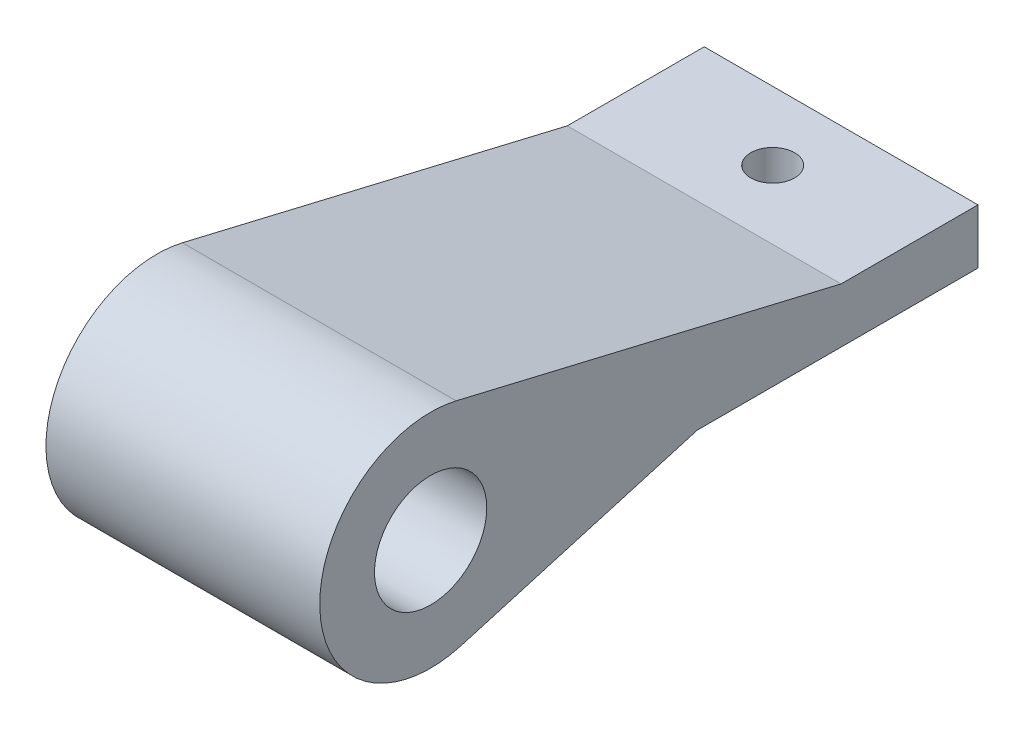
ISO-10303-21;
HEADER;
FILE_DESCRIPTION(('STEP AP214'),'2;1');
FILE_NAME('part.step','',(''),(''),'','','');
FILE_SCHEMA(('AUTOMOTIVE_DESIGN { 1 0 10303 214 1 1 1 1 }'));
ENDSEC;
DATA;
#1=APPLICATION_CONTEXT('core data for automotive mechanical design processes');
#2=APPLICATION_PROTOCOL_DEFINITION('international standard','automotive_design',2000,#1);
#3=PRODUCT_CONTEXT('',#1,'mechanical');
#4=PRODUCT('Part','Part','',(#3));
#5=PRODUCT_RELATED_PRODUCT_CATEGORY('part','',(#4));
#6=PRODUCT_DEFINITION_FORMATION('','',#4);
#7=PRODUCT_DEFINITION_CONTEXT('part definition',#1,'design');
#8=PRODUCT_DEFINITION('design','',#6,#7);
#9=PRODUCT_DEFINITION_SHAPE('','',#8);
#10=(LENGTH_UNIT() NAMED_UNIT(*) SI_UNIT(.MILLI.,.METRE.));
#11=(NAMED_UNIT(*) PLANE_ANGLE_UNIT() SI_UNIT($,.RADIAN.));
#12=(NAMED_UNIT(*) SI_UNIT($,.STERADIAN.) SOLID_ANGLE_UNIT());
#13=UNCERTAINTY_MEASURE_WITH_UNIT(LENGTH_MEASURE(1.E-05),#10,'distance_accuracy_value','');
#14=(GEOMETRIC_REPRESENTATION_CONTEXT(3) GLOBAL_UNCERTAINTY_ASSIGNED_CONTEXT((#13)) GLOBAL_UNIT_ASSIGNED_CONTEXT((#10,
#11,#12)) REPRESENTATION_CONTEXT('',''));
#15=CARTESIAN_POINT('',(0.,0.,0.));
#16=DIRECTION('',(0.,0.,1.));
#17=DIRECTION('',(1.,0.,0.));
#18=AXIS2_PLACEMENT_3D('',#15,#16,#17);
#19=CARTESIAN_POINT('',(20.,2.77903380821613,29.7363308106528));
#20=DIRECTION('',(1.,0.,0.));
#21=DIRECTION('',(0.,0.,-1.));
#22=AXIS2_PLACEMENT_3D('',#19,#20,#21);
#23=PLANE('',#22);
#24=DIRECTION('',(0.,0.278712638404029,-0.960374544224213));
#25=VECTOR('',#24,1.);
#26=CARTESIAN_POINT('',(20.,0.,10.25));
#27=LINE('',#26,#25);
#28=CARTESIAN_POINT('',(20.,-5.,27.4787584395802));
#29=VERTEX_POINT('',#28);
#30=CARTESIAN_POINT('',(20.,0.,10.25));
#31=VERTEX_POINT('',#30);
#32=EDGE_CURVE('E152',#29,#31,#27,.T.);
#33=ORIENTED_EDGE('',*,*,#32,.T.);
#34=DIRECTION('',(0.,0.,-1.));
#35=VECTOR('',#34,1.);
#36=CARTESIAN_POINT('',(20.,0.,10.25));
#37=LINE('',#36,#35);
#38=CARTESIAN_POINT('',(20.,0.,-10.25));
#39=VERTEX_POINT('',#38);
#40=EDGE_CURVE('E100',#31,#39,#37,.T.);
#41=ORIENTED_EDGE('',*,*,#40,.T.);
#42=DIRECTION('',(0.,1.,0.));
#43=VECTOR('',#42,1.);
#44=CARTESIAN_POINT('',(20.,4.,-10.25));
#45=LINE('',#44,#43);
#46=CARTESIAN_POINT('',(20.,4.,-10.25));
#47=VERTEX_POINT('',#46);
#48=EDGE_CURVE('E113',#39,#47,#45,.T.);
#49=ORIENTED_EDGE('',*,*,#48,.T.);
#50=DIRECTION('',(0.,0.,1.));
#51=VECTOR('',#50,1.);
#52=CARTESIAN_POINT('',(20.,4.,-0.249999999999997));
#53=LINE('',#52,#51);
#54=CARTESIAN_POINT('',(20.,4.,-0.249999999999997));
#55=VERTEX_POINT('',#54);
#56=EDGE_CURVE('E107',#47,#55,#53,.T.);
#57=ORIENTED_EDGE('',*,*,#56,.T.);
#58=DIRECTION('',(0.,0.230502099091851,0.973071827931654));
#59=VECTOR('',#58,1.);
#60=CARTESIAN_POINT('',(20.,4.,-0.249999999999997));
#61=LINE('',#60,#59);
#62=CARTESIAN_POINT('',(20.,10.6609156144625,27.8692638080088));
#63=VERTEX_POINT('',#62);
#64=EDGE_CURVE('E111',#55,#63,#61,.T.);
#65=ORIENTED_EDGE('',*,*,#64,.T.);
#66=CARTESIAN_POINT('',(20.,2.77903380821613,29.7363308106528));
#67=DIRECTION('',(1.,0.,0.));
#68=DIRECTION('',(0.,0.,-1.));
#69=AXIS2_PLACEMENT_3D('',#66,#67,#68);
#70=CIRCLE('',#69,8.1);
#71=EDGE_CURVE('E63',#63,#29,#70,.T.);
#72=ORIENTED_EDGE('',*,*,#71,.T.);
#73=EDGE_LOOP('',(#33,#41,#49,#57,#65,#72));
#74=FACE_BOUND('',#73,.T.);
#75=CARTESIAN_POINT('',(20.,2.77903380821613,29.7363308106528));
#76=DIRECTION('',(1.,0.,0.));
#77=DIRECTION('',(0.,0.,-1.));
#78=AXIS2_PLACEMENT_3D('',#75,#76,#77);
#79=CIRCLE('',#78,4.1);
#80=CARTESIAN_POINT('',(20.,2.77903380821613,25.6363308106528));
#81=VERTEX_POINT('',#80);
#82=EDGE_CURVE('E140',#81,#81,#79,.T.);
#83=ORIENTED_EDGE('',*,*,#82,.F.);
#84=EDGE_LOOP('',(#83));
#85=FACE_BOUND('',#84,.T.);
#86=ADVANCED_FACE('F45',(#74,#85),#23,.T.);
#87=CARTESIAN_POINT('',(0.,2.77903380821613,29.7363308106528));
#88=DIRECTION('',(1.,0.,0.));
#89=DIRECTION('',(0.,0.,-1.));
#90=AXIS2_PLACEMENT_3D('',#87,#88,#89);
#91=PLANE('',#90);
#92=DIRECTION('',(0.,0.278712638404029,-0.960374544224213));
#93=VECTOR('',#92,1.);
#94=CARTESIAN_POINT('',(0.,0.,10.25));
#95=LINE('',#94,#93);
#96=CARTESIAN_POINT('',(0.,-5.,27.4787584395802));
#97=VERTEX_POINT('',#96);
#98=CARTESIAN_POINT('',(0.,0.,10.25));
#99=VERTEX_POINT('',#98);
#100=EDGE_CURVE('E135',#97,#99,#95,.T.);
#101=ORIENTED_EDGE('',*,*,#100,.F.);
#102=CARTESIAN_POINT('',(0.,2.77903380821613,29.7363308106528));
#103=DIRECTION('',(1.,0.,0.));
#104=DIRECTION('',(0.,0.,-1.));
#105=AXIS2_PLACEMENT_3D('',#102,#103,#104);
#106=CIRCLE('',#105,8.1);
#107=CARTESIAN_POINT('',(0.,10.6609156144625,27.8692638080088));
#108=VERTEX_POINT('',#107);
#109=EDGE_CURVE('E92',#108,#97,#106,.T.);
#110=ORIENTED_EDGE('',*,*,#109,.F.);
#111=DIRECTION('',(0.,0.230502099091851,0.973071827931654));
#112=VECTOR('',#111,1.);
#113=CARTESIAN_POINT('',(0.,4.,-0.249999999999997));
#114=LINE('',#113,#112);
#115=CARTESIAN_POINT('',(0.,4.,-0.249999999999997));
#116=VERTEX_POINT('',#115);
#117=EDGE_CURVE('E86',#116,#108,#114,.T.);
#118=ORIENTED_EDGE('',*,*,#117,.F.);
#119=DIRECTION('',(0.,0.,1.));
#120=VECTOR('',#119,1.);
#121=CARTESIAN_POINT('',(0.,4.,-0.249999999999997));
#122=LINE('',#121,#120);
#123=CARTESIAN_POINT('',(0.,4.,-10.25));
#124=VERTEX_POINT('',#123);
#125=EDGE_CURVE('E122',#124,#116,#122,.T.);
#126=ORIENTED_EDGE('',*,*,#125,.F.);
#127=DIRECTION('',(0.,1.,0.));
#128=VECTOR('',#127,1.);
#129=CARTESIAN_POINT('',(0.,4.,-10.25));
#130=LINE('',#129,#128);
#131=CARTESIAN_POINT('',(0.,0.,-10.25));
#132=VERTEX_POINT('',#131);
#133=EDGE_CURVE('E143',#132,#124,#130,.T.);
#134=ORIENTED_EDGE('',*,*,#133,.F.);
#135=DIRECTION('',(0.,0.,-1.));
#136=VECTOR('',#135,1.);
#137=CARTESIAN_POINT('',(0.,0.,10.25));
#138=LINE('',#137,#136);
#139=EDGE_CURVE('E139',#99,#132,#138,.T.);
#140=ORIENTED_EDGE('',*,*,#139,.F.);
#141=EDGE_LOOP('',(#101,#110,#118,#126,#134,#140));
#142=FACE_BOUND('',#141,.T.);
#143=CARTESIAN_POINT('',(0.,2.77903380821613,29.7363308106528));
#144=DIRECTION('',(1.,0.,0.));
#145=DIRECTION('',(0.,0.,-1.));
#146=AXIS2_PLACEMENT_3D('',#143,#144,#145);
#147=CIRCLE('',#146,4.1);
#148=CARTESIAN_POINT('',(0.,2.77903380821613,25.6363308106528));
#149=VERTEX_POINT('',#148);
#150=EDGE_CURVE('E202',#149,#149,#147,.T.);
#151=ORIENTED_EDGE('',*,*,#150,.T.);
#152=EDGE_LOOP('',(#151));
#153=FACE_BOUND('',#152,.T.);
#154=ADVANCED_FACE('F165',(#142,#153),#91,.F.);
#155=CARTESIAN_POINT('',(20.,0.,10.25));
#156=DIRECTION('',(0.,0.960374544224213,0.278712638404029));
#157=DIRECTION('',(0.,-0.278712638404029,0.960374544224213));
#158=AXIS2_PLACEMENT_3D('',#155,#156,#157);
#159=PLANE('',#158);
#160=ORIENTED_EDGE('',*,*,#100,.T.);
#161=DIRECTION('',(-1.,0.,0.));
#162=VECTOR('',#161,1.);
#163=CARTESIAN_POINT('',(20.,0.,10.25));
#164=LINE('',#163,#162);
#165=EDGE_CURVE('E11',#31,#99,#164,.T.);
#166=ORIENTED_EDGE('',*,*,#165,.F.);
#167=ORIENTED_EDGE('',*,*,#32,.F.);
#168=DIRECTION('',(-1.,0.,0.));
#169=VECTOR('',#168,1.);
#170=CARTESIAN_POINT('',(20.,-5.,27.4787584395802));
#171=LINE('',#170,#169);
#172=EDGE_CURVE('E131',#29,#97,#171,.T.);
#173=ORIENTED_EDGE('',*,*,#172,.T.);
#174=EDGE_LOOP('',(#160,#166,#167,#173));
#175=FACE_BOUND('',#174,.T.);
#176=ADVANCED_FACE('F47',(#175),#159,.F.);
#177=CARTESIAN_POINT('',(20.,0.,10.25));
#178=DIRECTION('',(0.,1.,0.));
#179=DIRECTION('',(0.,0.,1.));
#180=AXIS2_PLACEMENT_3D('',#177,#178,#179);
#181=PLANE('',#180);
#182=CARTESIAN_POINT('',(10.,0.,-5.25));
#183=DIRECTION('',(0.,1.,0.));
#184=DIRECTION('',(0.,0.,1.));
#185=AXIS2_PLACEMENT_3D('',#182,#183,#184);
#186=CIRCLE('',#185,1.6);
#187=CARTESIAN_POINT('',(10.,0.,-3.65));
#188=VERTEX_POINT('',#187);
#189=EDGE_CURVE('E199',#188,#188,#186,.T.);
#190=ORIENTED_EDGE('',*,*,#189,.T.);
#191=EDGE_LOOP('',(#190));
#192=FACE_BOUND('',#191,.T.);
#193=ORIENTED_EDGE('',*,*,#139,.T.);
#194=DIRECTION('',(-1.,0.,0.));
#195=VECTOR('',#194,1.);
#196=CARTESIAN_POINT('',(20.,0.,-10.25));
#197=LINE('',#196,#195);
#198=EDGE_CURVE('E55',#39,#132,#197,.T.);
#199=ORIENTED_EDGE('',*,*,#198,.F.);
#200=ORIENTED_EDGE('',*,*,#40,.F.);
#201=ORIENTED_EDGE('',*,*,#165,.T.);
#202=EDGE_LOOP('',(#193,#199,#200,#201));
#203=FACE_BOUND('',#202,.T.);
#204=ADVANCED_FACE('F220',(#192,#203),#181,.F.);
#205=CARTESIAN_POINT('',(20.,4.,-10.25));
#206=DIRECTION('',(0.,0.,1.));
#207=DIRECTION('',(0.,-1.,0.));
#208=AXIS2_PLACEMENT_3D('',#205,#206,#207);
#209=PLANE('',#208);
#210=ORIENTED_EDGE('',*,*,#133,.T.);
#211=DIRECTION('',(-1.,0.,0.));
#212=VECTOR('',#211,1.);
#213=CARTESIAN_POINT('',(20.,4.,-10.25));
#214=LINE('',#213,#212);
#215=EDGE_CURVE('E124',#47,#124,#214,.T.);
#216=ORIENTED_EDGE('',*,*,#215,.F.);
#217=ORIENTED_EDGE('',*,*,#48,.F.);
#218=ORIENTED_EDGE('',*,*,#198,.T.);
#219=EDGE_LOOP('',(#210,#216,#217,#218));
#220=FACE_BOUND('',#219,.T.);
#221=ADVANCED_FACE('F162',(#220),#209,.F.);
#222=CARTESIAN_POINT('',(20.,4.,-0.249999999999997));
#223=DIRECTION('',(0.,-1.,0.));
#224=DIRECTION('',(0.,0.,-1.));
#225=AXIS2_PLACEMENT_3D('',#222,#223,#224);
#226=PLANE('',#225);
#227=CARTESIAN_POINT('',(10.,4.,-5.25));
#228=DIRECTION('',(0.,1.,0.));
#229=DIRECTION('',(0.,0.,1.));
#230=AXIS2_PLACEMENT_3D('',#227,#228,#229);
#231=CIRCLE('',#230,1.6);
#232=CARTESIAN_POINT('',(10.,4.,-3.65));
#233=VERTEX_POINT('',#232);
#234=EDGE_CURVE('E196',#233,#233,#231,.T.);
#235=ORIENTED_EDGE('',*,*,#234,.F.);
#236=EDGE_LOOP('',(#235));
#237=FACE_BOUND('',#236,.T.);
#238=ORIENTED_EDGE('',*,*,#125,.T.);
#239=DIRECTION('',(-1.,0.,0.));
#240=VECTOR('',#239,1.);
#241=CARTESIAN_POINT('',(20.,4.,-0.249999999999997));
#242=LINE('',#241,#240);
#243=EDGE_CURVE('E119',#55,#116,#242,.T.);
#244=ORIENTED_EDGE('',*,*,#243,.F.);
#245=ORIENTED_EDGE('',*,*,#56,.F.);
#246=ORIENTED_EDGE('',*,*,#215,.T.);
#247=EDGE_LOOP('',(#238,#244,#245,#246));
#248=FACE_BOUND('',#247,.T.);
#249=ADVANCED_FACE('F120',(#237,#248),#226,.F.);
#250=CARTESIAN_POINT('',(20.,4.,-0.249999999999997));
#251=DIRECTION('',(0.,-0.973071827931654,0.230502099091851));
#252=DIRECTION('',(0.,-0.230502099091851,-0.973071827931654));
#253=AXIS2_PLACEMENT_3D('',#250,#251,#252);
#254=PLANE('',#253);
#255=ORIENTED_EDGE('',*,*,#117,.T.);
#256=DIRECTION('',(-1.,0.,0.));
#257=VECTOR('',#256,1.);
#258=CARTESIAN_POINT('',(20.,10.6609156144625,27.8692638080088));
#259=LINE('',#258,#257);
#260=EDGE_CURVE('E125',#63,#108,#259,.T.);
#261=ORIENTED_EDGE('',*,*,#260,.F.);
#262=ORIENTED_EDGE('',*,*,#64,.F.);
#263=ORIENTED_EDGE('',*,*,#243,.T.);
#264=EDGE_LOOP('',(#255,#261,#262,#263));
#265=FACE_BOUND('',#264,.T.);
#266=ADVANCED_FACE('F127',(#265),#254,.F.);
#267=CARTESIAN_POINT('',(20.,2.77903380821613,29.7363308106528));
#268=DIRECTION('',(-1.,0.,0.));
#269=DIRECTION('',(0.,0.,1.));
#270=AXIS2_PLACEMENT_3D('',#267,#268,#269);
#271=CYLINDRICAL_SURFACE('',#270,8.1);
#272=ORIENTED_EDGE('',*,*,#109,.T.);
#273=ORIENTED_EDGE('',*,*,#172,.F.);
#274=ORIENTED_EDGE('',*,*,#71,.F.);
#275=ORIENTED_EDGE('',*,*,#260,.T.);
#276=EDGE_LOOP('',(#272,#273,#274,#275));
#277=FACE_BOUND('',#276,.T.);
#278=ADVANCED_FACE('F170',(#277),#271,.T.);
#279=CARTESIAN_POINT('',(20.,2.77903380821613,29.7363308106528));
#280=DIRECTION('',(-1.,0.,0.));
#281=DIRECTION('',(0.,0.,1.));
#282=AXIS2_PLACEMENT_3D('',#279,#280,#281);
#283=CYLINDRICAL_SURFACE('',#282,4.1);
#284=ORIENTED_EDGE('',*,*,#82,.T.);
#285=EDGE_LOOP('',(#284));
#286=FACE_BOUND('',#285,.T.);
#287=ORIENTED_EDGE('',*,*,#150,.F.);
#288=EDGE_LOOP('',(#287));
#289=FACE_BOUND('',#288,.T.);
#290=ADVANCED_FACE('F172',(#286,#289),#283,.F.);
#291=CARTESIAN_POINT('',(10.,-5.32096619178387,-5.25));
#292=DIRECTION('',(0.,1.,0.));
#293=DIRECTION('',(0.,0.,1.));
#294=AXIS2_PLACEMENT_3D('',#291,#292,#293);
#295=CYLINDRICAL_SURFACE('',#294,1.6);
#296=ORIENTED_EDGE('',*,*,#234,.T.);
#297=EDGE_LOOP('',(#296));
#298=FACE_BOUND('',#297,.T.);
#299=ORIENTED_EDGE('',*,*,#189,.F.);
#300=EDGE_LOOP('',(#299));
#301=FACE_BOUND('',#300,.T.);
#302=ADVANCED_FACE('F178',(#298,#301),#295,.F.);
#303=CLOSED_SHELL('',(#86,#154,#176,#204,#221,#249,#266,#278,#290,#302));
#304=MANIFOLD_SOLID_BREP('B2',#303);
#305=ADVANCED_BREP_SHAPE_REPRESENTATION('',(#18,#304),#14);
#306=SHAPE_DEFINITION_REPRESENTATION(#9,#305);
ENDSEC;
END-ISO-10303-21;
